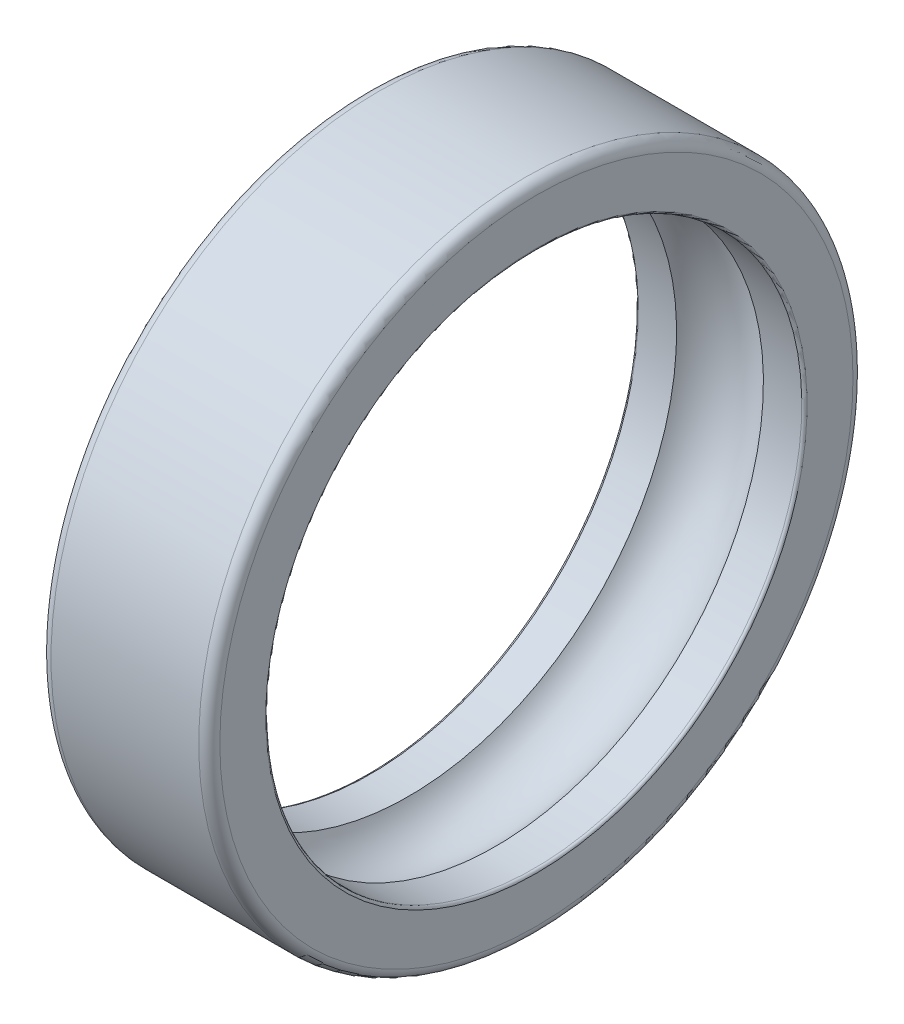
ISO-10303-21;
HEADER;
FILE_DESCRIPTION(('STEP AP214'),'2;1');
FILE_NAME('part.step','',(''),(''),'','','');
FILE_SCHEMA(('AUTOMOTIVE_DESIGN { 1 0 10303 214 1 1 1 1 }'));
ENDSEC;
DATA;
#1=APPLICATION_CONTEXT('core data for automotive mechanical design processes');
#2=APPLICATION_PROTOCOL_DEFINITION('international standard','automotive_design',2000,#1);
#3=PRODUCT_CONTEXT('',#1,'mechanical');
#4=PRODUCT('Part','Part','',(#3));
#5=PRODUCT_RELATED_PRODUCT_CATEGORY('part','',(#4));
#6=PRODUCT_DEFINITION_FORMATION('','',#4);
#7=PRODUCT_DEFINITION_CONTEXT('part definition',#1,'design');
#8=PRODUCT_DEFINITION('design','',#6,#7);
#9=PRODUCT_DEFINITION_SHAPE('','',#8);
#10=(LENGTH_UNIT() NAMED_UNIT(*) SI_UNIT(.MILLI.,.METRE.));
#11=(NAMED_UNIT(*) PLANE_ANGLE_UNIT() SI_UNIT($,.RADIAN.));
#12=(NAMED_UNIT(*) SI_UNIT($,.STERADIAN.) SOLID_ANGLE_UNIT());
#13=UNCERTAINTY_MEASURE_WITH_UNIT(LENGTH_MEASURE(1.E-05),#10,'distance_accuracy_value','');
#14=(GEOMETRIC_REPRESENTATION_CONTEXT(3) GLOBAL_UNCERTAINTY_ASSIGNED_CONTEXT((#13)) GLOBAL_UNIT_ASSIGNED_CONTEXT((#10,
#11,#12)) REPRESENTATION_CONTEXT('',''));
#15=CARTESIAN_POINT('',(0.,0.,0.));
#16=DIRECTION('',(0.,0.,1.));
#17=DIRECTION('',(1.,0.,0.));
#18=AXIS2_PLACEMENT_3D('',#15,#16,#17);
#19=CARTESIAN_POINT('',(15.75,0.,0.));
#20=DIRECTION('',(1.,0.,0.));
#21=DIRECTION('',(0.,0.,-1.));
#22=AXIS2_PLACEMENT_3D('',#19,#20,#21);
#23=TOROIDAL_SURFACE('',#22,25.65,0.25);
#24=CARTESIAN_POINT('',(16.,0.,0.));
#25=DIRECTION('',(1.,0.,0.));
#26=DIRECTION('',(0.,1.,0.));
#27=AXIS2_PLACEMENT_3D('',#24,#25,#26);
#28=CIRCLE('',#27,25.65);
#29=CARTESIAN_POINT('',(16.,25.65,0.));
#30=VERTEX_POINT('',#29);
#31=EDGE_CURVE('E11',#30,#30,#28,.T.);
#32=ORIENTED_EDGE('',*,*,#31,.T.);
#33=EDGE_LOOP('',(#32));
#34=FACE_BOUND('',#33,.T.);
#35=CARTESIAN_POINT('',(15.75,0.,0.));
#36=DIRECTION('',(1.,0.,0.));
#37=DIRECTION('',(0.,1.,0.));
#38=AXIS2_PLACEMENT_3D('',#35,#36,#37);
#39=CIRCLE('',#38,25.4);
#40=CARTESIAN_POINT('',(15.75,25.4,0.));
#41=VERTEX_POINT('',#40);
#42=EDGE_CURVE('E69',#41,#41,#39,.T.);
#43=ORIENTED_EDGE('',*,*,#42,.F.);
#44=EDGE_LOOP('',(#43));
#45=FACE_BOUND('',#44,.T.);
#46=ADVANCED_FACE('F16',(#34,#45),#23,.T.);
#47=CARTESIAN_POINT('',(16.,27.825,0.));
#48=DIRECTION('',(1.,0.,0.));
#49=DIRECTION('',(0.,1.,0.));
#50=AXIS2_PLACEMENT_3D('',#47,#48,#49);
#51=PLANE('',#50);
#52=CARTESIAN_POINT('',(16.,0.,0.));
#53=DIRECTION('',(1.,0.,0.));
#54=DIRECTION('',(0.,1.,0.));
#55=AXIS2_PLACEMENT_3D('',#52,#53,#54);
#56=CIRCLE('',#55,30.);
#57=CARTESIAN_POINT('',(16.,30.,0.));
#58=VERTEX_POINT('',#57);
#59=EDGE_CURVE('E26',#58,#58,#56,.T.);
#60=ORIENTED_EDGE('',*,*,#59,.T.);
#61=EDGE_LOOP('',(#60));
#62=FACE_BOUND('',#61,.T.);
#63=ORIENTED_EDGE('',*,*,#31,.F.);
#64=EDGE_LOOP('',(#63));
#65=FACE_BOUND('',#64,.T.);
#66=ADVANCED_FACE('F100',(#62,#65),#51,.T.);
#67=CARTESIAN_POINT('',(15.,0.,0.));
#68=DIRECTION('',(1.,0.,0.));
#69=DIRECTION('',(0.,0.,-1.));
#70=AXIS2_PLACEMENT_3D('',#67,#68,#69);
#71=TOROIDAL_SURFACE('',#70,30.,1.);
#72=CARTESIAN_POINT('',(15.,0.,0.));
#73=DIRECTION('',(1.,0.,0.));
#74=DIRECTION('',(0.,1.,0.));
#75=AXIS2_PLACEMENT_3D('',#72,#73,#74);
#76=CIRCLE('',#75,31.);
#77=CARTESIAN_POINT('',(15.,31.,0.));
#78=VERTEX_POINT('',#77);
#79=EDGE_CURVE('E67',#78,#78,#76,.T.);
#80=ORIENTED_EDGE('',*,*,#79,.T.);
#81=EDGE_LOOP('',(#80));
#82=FACE_BOUND('',#81,.T.);
#83=ORIENTED_EDGE('',*,*,#59,.F.);
#84=EDGE_LOOP('',(#83));
#85=FACE_BOUND('',#84,.T.);
#86=ADVANCED_FACE('F18',(#82,#85),#71,.T.);
#87=CARTESIAN_POINT('',(8.,0.,0.));
#88=DIRECTION('',(-1.,0.,0.));
#89=DIRECTION('',(0.,1.,0.));
#90=AXIS2_PLACEMENT_3D('',#87,#88,#89);
#91=CYLINDRICAL_SURFACE('',#90,31.);
#92=CARTESIAN_POINT('',(1.,0.,0.));
#93=DIRECTION('',(1.,0.,0.));
#94=DIRECTION('',(0.,1.,0.));
#95=AXIS2_PLACEMENT_3D('',#92,#93,#94);
#96=CIRCLE('',#95,31.);
#97=CARTESIAN_POINT('',(1.,31.,0.));
#98=VERTEX_POINT('',#97);
#99=EDGE_CURVE('E62',#98,#98,#96,.T.);
#100=ORIENTED_EDGE('',*,*,#99,.T.);
#101=EDGE_LOOP('',(#100));
#102=FACE_BOUND('',#101,.T.);
#103=ORIENTED_EDGE('',*,*,#79,.F.);
#104=EDGE_LOOP('',(#103));
#105=FACE_BOUND('',#104,.T.);
#106=ADVANCED_FACE('F82',(#102,#105),#91,.T.);
#107=CARTESIAN_POINT('',(1.,0.,0.));
#108=DIRECTION('',(1.,0.,0.));
#109=DIRECTION('',(0.,0.,-1.));
#110=AXIS2_PLACEMENT_3D('',#107,#108,#109);
#111=TOROIDAL_SURFACE('',#110,30.,1.);
#112=CARTESIAN_POINT('',(0.,0.,0.));
#113=DIRECTION('',(1.,0.,0.));
#114=DIRECTION('',(0.,1.,0.));
#115=AXIS2_PLACEMENT_3D('',#112,#113,#114);
#116=CIRCLE('',#115,30.);
#117=CARTESIAN_POINT('',(0.,30.,0.));
#118=VERTEX_POINT('',#117);
#119=EDGE_CURVE('E20',#118,#118,#116,.T.);
#120=ORIENTED_EDGE('',*,*,#119,.T.);
#121=EDGE_LOOP('',(#120));
#122=FACE_BOUND('',#121,.T.);
#123=ORIENTED_EDGE('',*,*,#99,.F.);
#124=EDGE_LOOP('',(#123));
#125=FACE_BOUND('',#124,.T.);
#126=ADVANCED_FACE('F85',(#122,#125),#111,.T.);
#127=CARTESIAN_POINT('',(0.,27.825,0.));
#128=DIRECTION('',(-1.,0.,0.));
#129=DIRECTION('',(0.,-1.,0.));
#130=AXIS2_PLACEMENT_3D('',#127,#128,#129);
#131=PLANE('',#130);
#132=CARTESIAN_POINT('',(0.,0.,0.));
#133=DIRECTION('',(1.,0.,0.));
#134=DIRECTION('',(0.,1.,0.));
#135=AXIS2_PLACEMENT_3D('',#132,#133,#134);
#136=CIRCLE('',#135,25.65);
#137=CARTESIAN_POINT('',(0.,25.65,0.));
#138=VERTEX_POINT('',#137);
#139=EDGE_CURVE('E56',#138,#138,#136,.T.);
#140=ORIENTED_EDGE('',*,*,#139,.T.);
#141=EDGE_LOOP('',(#140));
#142=FACE_BOUND('',#141,.T.);
#143=ORIENTED_EDGE('',*,*,#119,.F.);
#144=EDGE_LOOP('',(#143));
#145=FACE_BOUND('',#144,.T.);
#146=ADVANCED_FACE('F57',(#142,#145),#131,.T.);
#147=CARTESIAN_POINT('',(0.25,0.,0.));
#148=DIRECTION('',(1.,0.,0.));
#149=DIRECTION('',(0.,0.,-1.));
#150=AXIS2_PLACEMENT_3D('',#147,#148,#149);
#151=TOROIDAL_SURFACE('',#150,25.65,0.25);
#152=CARTESIAN_POINT('',(0.25,0.,0.));
#153=DIRECTION('',(1.,0.,0.));
#154=DIRECTION('',(0.,1.,0.));
#155=AXIS2_PLACEMENT_3D('',#152,#153,#154);
#156=CIRCLE('',#155,25.4);
#157=CARTESIAN_POINT('',(0.25,25.4,0.));
#158=VERTEX_POINT('',#157);
#159=EDGE_CURVE('E60',#158,#158,#156,.T.);
#160=ORIENTED_EDGE('',*,*,#159,.T.);
#161=EDGE_LOOP('',(#160));
#162=FACE_BOUND('',#161,.T.);
#163=ORIENTED_EDGE('',*,*,#139,.F.);
#164=EDGE_LOOP('',(#163));
#165=FACE_BOUND('',#164,.T.);
#166=ADVANCED_FACE('F94',(#162,#165),#151,.T.);
#167=CARTESIAN_POINT('',(2.068218153887,0.,0.));
#168=DIRECTION('',(-1.,0.,0.));
#169=DIRECTION('',(0.,1.,0.));
#170=AXIS2_PLACEMENT_3D('',#167,#168,#169);
#171=CYLINDRICAL_SURFACE('',#170,25.4);
#172=CARTESIAN_POINT('',(3.886436307774,0.,0.));
#173=DIRECTION('',(1.,0.,0.));
#174=DIRECTION('',(0.,1.,0.));
#175=AXIS2_PLACEMENT_3D('',#172,#173,#174);
#176=CIRCLE('',#175,25.4);
#177=CARTESIAN_POINT('',(3.886436307774,25.4,0.));
#178=VERTEX_POINT('',#177);
#179=EDGE_CURVE('E63',#178,#178,#176,.T.);
#180=ORIENTED_EDGE('',*,*,#179,.T.);
#181=EDGE_LOOP('',(#180));
#182=FACE_BOUND('',#181,.T.);
#183=ORIENTED_EDGE('',*,*,#159,.F.);
#184=EDGE_LOOP('',(#183));
#185=FACE_BOUND('',#184,.T.);
#186=ADVANCED_FACE('F107',(#182,#185),#171,.F.);
#187=CARTESIAN_POINT('',(8.,0.,0.));
#188=DIRECTION('',(1.,0.,0.));
#189=DIRECTION('',(0.,0.,-1.));
#190=AXIS2_PLACEMENT_3D('',#187,#188,#189);
#191=TOROIDAL_SURFACE('',#190,23.,4.7625);
#192=CARTESIAN_POINT('',(12.113563692226,0.,0.));
#193=DIRECTION('',(1.,0.,0.));
#194=DIRECTION('',(0.,1.,0.));
#195=AXIS2_PLACEMENT_3D('',#192,#193,#194);
#196=CIRCLE('',#195,25.4);
#197=CARTESIAN_POINT('',(12.113563692226,25.4,0.));
#198=VERTEX_POINT('',#197);
#199=EDGE_CURVE('E68',#198,#198,#196,.T.);
#200=ORIENTED_EDGE('',*,*,#199,.T.);
#201=EDGE_LOOP('',(#200));
#202=FACE_BOUND('',#201,.T.);
#203=ORIENTED_EDGE('',*,*,#179,.F.);
#204=EDGE_LOOP('',(#203));
#205=FACE_BOUND('',#204,.T.);
#206=ADVANCED_FACE('F109',(#202,#205),#191,.F.);
#207=CARTESIAN_POINT('',(13.931781846113,0.,0.));
#208=DIRECTION('',(-1.,0.,0.));
#209=DIRECTION('',(0.,1.,0.));
#210=AXIS2_PLACEMENT_3D('',#207,#208,#209);
#211=CYLINDRICAL_SURFACE('',#210,25.4);
#212=ORIENTED_EDGE('',*,*,#42,.T.);
#213=EDGE_LOOP('',(#212));
#214=FACE_BOUND('',#213,.T.);
#215=ORIENTED_EDGE('',*,*,#199,.F.);
#216=EDGE_LOOP('',(#215));
#217=FACE_BOUND('',#216,.T.);
#218=ADVANCED_FACE('F115',(#214,#217),#211,.F.);
#219=CLOSED_SHELL('',(#46,#66,#86,#106,#126,#146,#166,#186,#206,#218));
#220=MANIFOLD_SOLID_BREP('B1',#219);
#221=ADVANCED_BREP_SHAPE_REPRESENTATION('',(#18,#220),#14);
#222=SHAPE_DEFINITION_REPRESENTATION(#9,#221);
ENDSEC;
END-ISO-10303-21;
